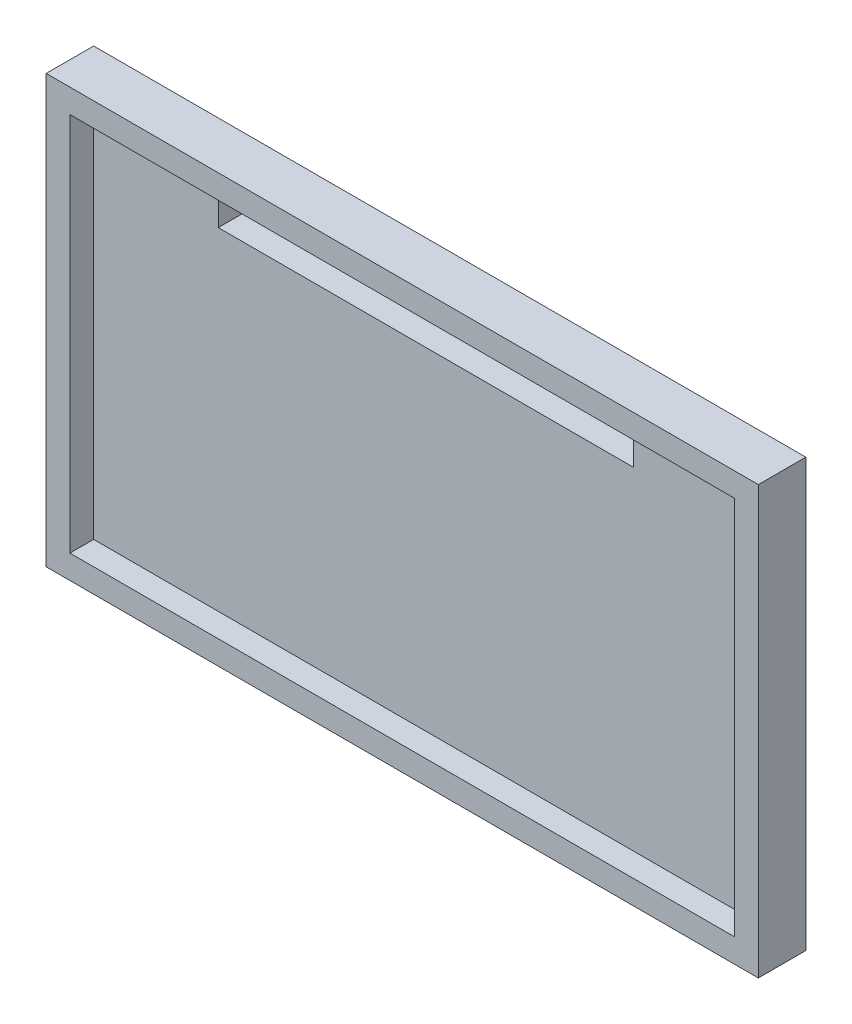
ISO-10303-21;
HEADER;
FILE_DESCRIPTION(('STEP AP214'),'2;1');
FILE_NAME('part.step','',(''),(''),'','','');
FILE_SCHEMA(('AUTOMOTIVE_DESIGN { 1 0 10303 214 1 1 1 1 }'));
ENDSEC;
DATA;
#1=APPLICATION_CONTEXT('core data for automotive mechanical design processes');
#2=APPLICATION_PROTOCOL_DEFINITION('international standard','automotive_design',2000,#1);
#3=PRODUCT_CONTEXT('',#1,'mechanical');
#4=PRODUCT('Part','Part','',(#3));
#5=PRODUCT_RELATED_PRODUCT_CATEGORY('part','',(#4));
#6=PRODUCT_DEFINITION_FORMATION('','',#4);
#7=PRODUCT_DEFINITION_CONTEXT('part definition',#1,'design');
#8=PRODUCT_DEFINITION('design','',#6,#7);
#9=PRODUCT_DEFINITION_SHAPE('','',#8);
#10=(LENGTH_UNIT() NAMED_UNIT(*) SI_UNIT(.MILLI.,.METRE.));
#11=(NAMED_UNIT(*) PLANE_ANGLE_UNIT() SI_UNIT($,.RADIAN.));
#12=(NAMED_UNIT(*) SI_UNIT($,.STERADIAN.) SOLID_ANGLE_UNIT());
#13=UNCERTAINTY_MEASURE_WITH_UNIT(LENGTH_MEASURE(1.E-05),#10,'distance_accuracy_value','');
#14=(GEOMETRIC_REPRESENTATION_CONTEXT(3) GLOBAL_UNCERTAINTY_ASSIGNED_CONTEXT((#13)) GLOBAL_UNIT_ASSIGNED_CONTEXT((#10,
#11,#12)) REPRESENTATION_CONTEXT('',''));
#15=CARTESIAN_POINT('',(0.,0.,0.));
#16=DIRECTION('',(0.,0.,1.));
#17=DIRECTION('',(1.,0.,0.));
#18=AXIS2_PLACEMENT_3D('',#15,#16,#17);
#19=CARTESIAN_POINT('',(0.,0.,2.));
#20=DIRECTION('',(0.,0.,1.));
#21=DIRECTION('',(1.,0.,0.));
#22=AXIS2_PLACEMENT_3D('',#19,#20,#21);
#23=PLANE('',#22);
#24=DIRECTION('',(0.,1.,0.));
#25=VECTOR('',#24,1.);
#26=CARTESIAN_POINT('',(28.,-16.,2.));
#27=LINE('',#26,#25);
#28=CARTESIAN_POINT('',(28.,-16.,2.));
#29=VERTEX_POINT('',#28);
#30=CARTESIAN_POINT('',(28.,16.,2.));
#31=VERTEX_POINT('',#30);
#32=EDGE_CURVE('E164',#29,#31,#27,.T.);
#33=ORIENTED_EDGE('',*,*,#32,.T.);
#34=DIRECTION('',(-1.,0.,0.));
#35=VECTOR('',#34,1.);
#36=CARTESIAN_POINT('',(28.,16.,2.));
#37=LINE('',#36,#35);
#38=CARTESIAN_POINT('',(17.5,16.,2.));
#39=VERTEX_POINT('',#38);
#40=EDGE_CURVE('E50',#31,#39,#37,.T.);
#41=ORIENTED_EDGE('',*,*,#40,.T.);
#42=DIRECTION('',(0.,1.,0.));
#43=VECTOR('',#42,1.);
#44=CARTESIAN_POINT('',(17.5,16.,2.));
#45=LINE('',#44,#43);
#46=CARTESIAN_POINT('',(17.5,12.,2.));
#47=VERTEX_POINT('',#46);
#48=EDGE_CURVE('E198',#47,#39,#45,.T.);
#49=ORIENTED_EDGE('',*,*,#48,.F.);
#50=DIRECTION('',(1.,0.,0.));
#51=VECTOR('',#50,1.);
#52=CARTESIAN_POINT('',(-17.5,12.,2.));
#53=LINE('',#52,#51);
#54=CARTESIAN_POINT('',(-17.5,12.,2.));
#55=VERTEX_POINT('',#54);
#56=EDGE_CURVE('E206',#55,#47,#53,.T.);
#57=ORIENTED_EDGE('',*,*,#56,.F.);
#58=DIRECTION('',(0.,-1.,0.));
#59=VECTOR('',#58,1.);
#60=CARTESIAN_POINT('',(-17.5,16.,2.));
#61=LINE('',#60,#59);
#62=CARTESIAN_POINT('',(-17.5,16.,2.));
#63=VERTEX_POINT('',#62);
#64=EDGE_CURVE('E202',#63,#55,#61,.T.);
#65=ORIENTED_EDGE('',*,*,#64,.F.);
#66=CARTESIAN_POINT('',(-28.,16.,2.));
#67=VERTEX_POINT('',#66);
#68=EDGE_CURVE('E11',#63,#67,#37,.T.);
#69=ORIENTED_EDGE('',*,*,#68,.T.);
#70=DIRECTION('',(0.,-1.,0.));
#71=VECTOR('',#70,1.);
#72=CARTESIAN_POINT('',(-28.,16.,2.));
#73=LINE('',#72,#71);
#74=CARTESIAN_POINT('',(-28.,-16.,2.));
#75=VERTEX_POINT('',#74);
#76=EDGE_CURVE('E168',#67,#75,#73,.T.);
#77=ORIENTED_EDGE('',*,*,#76,.T.);
#78=DIRECTION('',(1.,0.,0.));
#79=VECTOR('',#78,1.);
#80=CARTESIAN_POINT('',(-28.,-16.,2.));
#81=LINE('',#80,#79);
#82=EDGE_CURVE('E142',#75,#29,#81,.T.);
#83=ORIENTED_EDGE('',*,*,#82,.T.);
#84=EDGE_LOOP('',(#33,#41,#49,#57,#65,#69,#77,#83));
#85=FACE_BOUND('',#84,.T.);
#86=ADVANCED_FACE('F39',(#85),#23,.T.);
#87=CARTESIAN_POINT('',(0.,0.,0.));
#88=DIRECTION('',(0.,0.,1.));
#89=DIRECTION('',(1.,0.,0.));
#90=AXIS2_PLACEMENT_3D('',#87,#88,#89);
#91=PLANE('',#90);
#92=DIRECTION('',(0.,1.,0.));
#93=VECTOR('',#92,1.);
#94=CARTESIAN_POINT('',(30.,18.,0.));
#95=LINE('',#94,#93);
#96=CARTESIAN_POINT('',(30.,-18.,0.));
#97=VERTEX_POINT('',#96);
#98=CARTESIAN_POINT('',(30.,18.,0.));
#99=VERTEX_POINT('',#98);
#100=EDGE_CURVE('E236',#97,#99,#95,.T.);
#101=ORIENTED_EDGE('',*,*,#100,.F.);
#102=DIRECTION('',(1.,0.,0.));
#103=VECTOR('',#102,1.);
#104=CARTESIAN_POINT('',(-30.,-18.,0.));
#105=LINE('',#104,#103);
#106=CARTESIAN_POINT('',(-30.,-18.,0.));
#107=VERTEX_POINT('',#106);
#108=EDGE_CURVE('E246',#107,#97,#105,.T.);
#109=ORIENTED_EDGE('',*,*,#108,.F.);
#110=DIRECTION('',(0.,-1.,0.));
#111=VECTOR('',#110,1.);
#112=CARTESIAN_POINT('',(-30.,18.,0.));
#113=LINE('',#112,#111);
#114=CARTESIAN_POINT('',(-30.,18.,0.));
#115=VERTEX_POINT('',#114);
#116=EDGE_CURVE('E243',#115,#107,#113,.T.);
#117=ORIENTED_EDGE('',*,*,#116,.F.);
#118=DIRECTION('',(-1.,0.,0.));
#119=VECTOR('',#118,1.);
#120=CARTESIAN_POINT('',(-30.,18.,0.));
#121=LINE('',#120,#119);
#122=EDGE_CURVE('E240',#99,#115,#121,.T.);
#123=ORIENTED_EDGE('',*,*,#122,.F.);
#124=EDGE_LOOP('',(#101,#109,#117,#123));
#125=FACE_BOUND('',#124,.T.);
#126=DIRECTION('',(0.,1.,0.));
#127=VECTOR('',#126,1.);
#128=CARTESIAN_POINT('',(17.5,16.,0.));
#129=LINE('',#128,#127);
#130=CARTESIAN_POINT('',(17.5,12.,0.));
#131=VERTEX_POINT('',#130);
#132=CARTESIAN_POINT('',(17.5,16.,0.));
#133=VERTEX_POINT('',#132);
#134=EDGE_CURVE('E197',#131,#133,#129,.T.);
#135=ORIENTED_EDGE('',*,*,#134,.T.);
#136=DIRECTION('',(-1.,0.,0.));
#137=VECTOR('',#136,1.);
#138=CARTESIAN_POINT('',(-17.5,16.,0.));
#139=LINE('',#138,#137);
#140=CARTESIAN_POINT('',(-17.5,16.,0.));
#141=VERTEX_POINT('',#140);
#142=EDGE_CURVE('E213',#133,#141,#139,.T.);
#143=ORIENTED_EDGE('',*,*,#142,.T.);
#144=DIRECTION('',(0.,-1.,0.));
#145=VECTOR('',#144,1.);
#146=CARTESIAN_POINT('',(-17.5,16.,0.));
#147=LINE('',#146,#145);
#148=CARTESIAN_POINT('',(-17.5,12.,0.));
#149=VERTEX_POINT('',#148);
#150=EDGE_CURVE('E217',#141,#149,#147,.T.);
#151=ORIENTED_EDGE('',*,*,#150,.T.);
#152=DIRECTION('',(1.,0.,0.));
#153=VECTOR('',#152,1.);
#154=CARTESIAN_POINT('',(-17.5,12.,0.));
#155=LINE('',#154,#153);
#156=EDGE_CURVE('E203',#149,#131,#155,.T.);
#157=ORIENTED_EDGE('',*,*,#156,.T.);
#158=EDGE_LOOP('',(#135,#143,#151,#157));
#159=FACE_BOUND('',#158,.T.);
#160=ADVANCED_FACE('F272',(#125,#159),#91,.F.);
#161=CARTESIAN_POINT('',(30.,18.,2.));
#162=DIRECTION('',(-1.,0.,0.));
#163=DIRECTION('',(0.,-1.,0.));
#164=AXIS2_PLACEMENT_3D('',#161,#162,#163);
#165=PLANE('',#164);
#166=ORIENTED_EDGE('',*,*,#100,.T.);
#167=DIRECTION('',(0.,0.,-1.));
#168=VECTOR('',#167,1.);
#169=CARTESIAN_POINT('',(30.,18.,2.));
#170=LINE('',#169,#168);
#171=CARTESIAN_POINT('',(30.,18.,4.));
#172=VERTEX_POINT('',#171);
#173=EDGE_CURVE('E43',#172,#99,#170,.T.);
#174=ORIENTED_EDGE('',*,*,#173,.F.);
#175=DIRECTION('',(0.,1.,0.));
#176=VECTOR('',#175,1.);
#177=CARTESIAN_POINT('',(30.,-18.,4.));
#178=LINE('',#177,#176);
#179=CARTESIAN_POINT('',(30.,-18.,4.));
#180=VERTEX_POINT('',#179);
#181=EDGE_CURVE('E149',#180,#172,#178,.T.);
#182=ORIENTED_EDGE('',*,*,#181,.F.);
#183=DIRECTION('',(0.,0.,-1.));
#184=VECTOR('',#183,1.);
#185=CARTESIAN_POINT('',(30.,-18.,2.));
#186=LINE('',#185,#184);
#187=EDGE_CURVE('E249',#180,#97,#186,.T.);
#188=ORIENTED_EDGE('',*,*,#187,.T.);
#189=EDGE_LOOP('',(#166,#174,#182,#188));
#190=FACE_BOUND('',#189,.T.);
#191=ADVANCED_FACE('F41',(#190),#165,.F.);
#192=CARTESIAN_POINT('',(-30.,18.,2.));
#193=DIRECTION('',(0.,-1.,0.));
#194=DIRECTION('',(0.,0.,-1.));
#195=AXIS2_PLACEMENT_3D('',#192,#193,#194);
#196=PLANE('',#195);
#197=ORIENTED_EDGE('',*,*,#122,.T.);
#198=DIRECTION('',(0.,0.,-1.));
#199=VECTOR('',#198,1.);
#200=CARTESIAN_POINT('',(-30.,18.,2.));
#201=LINE('',#200,#199);
#202=CARTESIAN_POINT('',(-30.,18.,4.));
#203=VERTEX_POINT('',#202);
#204=EDGE_CURVE('E256',#203,#115,#201,.T.);
#205=ORIENTED_EDGE('',*,*,#204,.F.);
#206=DIRECTION('',(-1.,0.,0.));
#207=VECTOR('',#206,1.);
#208=CARTESIAN_POINT('',(30.,18.,4.));
#209=LINE('',#208,#207);
#210=EDGE_CURVE('E185',#172,#203,#209,.T.);
#211=ORIENTED_EDGE('',*,*,#210,.F.);
#212=ORIENTED_EDGE('',*,*,#173,.T.);
#213=EDGE_LOOP('',(#197,#205,#211,#212));
#214=FACE_BOUND('',#213,.T.);
#215=ADVANCED_FACE('F266',(#214),#196,.F.);
#216=CARTESIAN_POINT('',(-30.,18.,2.));
#217=DIRECTION('',(1.,0.,0.));
#218=DIRECTION('',(0.,0.,-1.));
#219=AXIS2_PLACEMENT_3D('',#216,#217,#218);
#220=PLANE('',#219);
#221=ORIENTED_EDGE('',*,*,#116,.T.);
#222=DIRECTION('',(0.,0.,-1.));
#223=VECTOR('',#222,1.);
#224=CARTESIAN_POINT('',(-30.,-18.,2.));
#225=LINE('',#224,#223);
#226=CARTESIAN_POINT('',(-30.,-18.,4.));
#227=VERTEX_POINT('',#226);
#228=EDGE_CURVE('E253',#227,#107,#225,.T.);
#229=ORIENTED_EDGE('',*,*,#228,.F.);
#230=DIRECTION('',(0.,-1.,0.));
#231=VECTOR('',#230,1.);
#232=CARTESIAN_POINT('',(-30.,18.,4.));
#233=LINE('',#232,#231);
#234=EDGE_CURVE('E189',#203,#227,#233,.T.);
#235=ORIENTED_EDGE('',*,*,#234,.F.);
#236=ORIENTED_EDGE('',*,*,#204,.T.);
#237=EDGE_LOOP('',(#221,#229,#235,#236));
#238=FACE_BOUND('',#237,.T.);
#239=ADVANCED_FACE('F274',(#238),#220,.F.);
#240=CARTESIAN_POINT('',(-30.,-18.,2.));
#241=DIRECTION('',(0.,1.,0.));
#242=DIRECTION('',(0.,0.,1.));
#243=AXIS2_PLACEMENT_3D('',#240,#241,#242);
#244=PLANE('',#243);
#245=ORIENTED_EDGE('',*,*,#108,.T.);
#246=ORIENTED_EDGE('',*,*,#187,.F.);
#247=DIRECTION('',(1.,0.,0.));
#248=VECTOR('',#247,1.);
#249=CARTESIAN_POINT('',(-30.,-18.,4.));
#250=LINE('',#249,#248);
#251=EDGE_CURVE('E193',#227,#180,#250,.T.);
#252=ORIENTED_EDGE('',*,*,#251,.F.);
#253=ORIENTED_EDGE('',*,*,#228,.T.);
#254=EDGE_LOOP('',(#245,#246,#252,#253));
#255=FACE_BOUND('',#254,.T.);
#256=ADVANCED_FACE('F277',(#255),#244,.F.);
#257=CARTESIAN_POINT('',(17.5,16.,2.));
#258=DIRECTION('',(-1.,0.,0.));
#259=DIRECTION('',(0.,0.,1.));
#260=AXIS2_PLACEMENT_3D('',#257,#258,#259);
#261=PLANE('',#260);
#262=ORIENTED_EDGE('',*,*,#134,.F.);
#263=DIRECTION('',(0.,0.,-1.));
#264=VECTOR('',#263,1.);
#265=CARTESIAN_POINT('',(17.5,12.,2.));
#266=LINE('',#265,#264);
#267=EDGE_CURVE('E209',#47,#131,#266,.T.);
#268=ORIENTED_EDGE('',*,*,#267,.F.);
#269=ORIENTED_EDGE('',*,*,#48,.T.);
#270=DIRECTION('',(0.,0.,-1.));
#271=VECTOR('',#270,1.);
#272=CARTESIAN_POINT('',(17.5,16.,2.));
#273=LINE('',#272,#271);
#274=EDGE_CURVE('E232',#39,#133,#273,.T.);
#275=ORIENTED_EDGE('',*,*,#274,.T.);
#276=EDGE_LOOP('',(#262,#268,#269,#275));
#277=FACE_BOUND('',#276,.T.);
#278=ADVANCED_FACE('F301',(#277),#261,.T.);
#279=CARTESIAN_POINT('',(-17.5,16.,2.));
#280=DIRECTION('',(0.,-1.,0.));
#281=DIRECTION('',(0.,0.,-1.));
#282=AXIS2_PLACEMENT_3D('',#279,#280,#281);
#283=PLANE('',#282);
#284=ORIENTED_EDGE('',*,*,#142,.F.);
#285=ORIENTED_EDGE('',*,*,#274,.F.);
#286=ORIENTED_EDGE('',*,*,#40,.F.);
#287=DIRECTION('',(0.,0.,-1.));
#288=VECTOR('',#287,1.);
#289=CARTESIAN_POINT('',(28.,16.,4.));
#290=LINE('',#289,#288);
#291=CARTESIAN_POINT('',(28.,16.,4.));
#292=VERTEX_POINT('',#291);
#293=EDGE_CURVE('E135',#292,#31,#290,.T.);
#294=ORIENTED_EDGE('',*,*,#293,.F.);
#295=DIRECTION('',(-1.,0.,0.));
#296=VECTOR('',#295,1.);
#297=CARTESIAN_POINT('',(28.,16.,4.));
#298=LINE('',#297,#296);
#299=CARTESIAN_POINT('',(-28.,16.,4.));
#300=VERTEX_POINT('',#299);
#301=EDGE_CURVE('E141',#292,#300,#298,.T.);
#302=ORIENTED_EDGE('',*,*,#301,.T.);
#303=DIRECTION('',(0.,0.,-1.));
#304=VECTOR('',#303,1.);
#305=CARTESIAN_POINT('',(-28.,16.,4.));
#306=LINE('',#305,#304);
#307=EDGE_CURVE('E150',#300,#67,#306,.T.);
#308=ORIENTED_EDGE('',*,*,#307,.T.);
#309=ORIENTED_EDGE('',*,*,#68,.F.);
#310=DIRECTION('',(0.,0.,-1.));
#311=VECTOR('',#310,1.);
#312=CARTESIAN_POINT('',(-17.5,16.,2.));
#313=LINE('',#312,#311);
#314=EDGE_CURVE('E229',#63,#141,#313,.T.);
#315=ORIENTED_EDGE('',*,*,#314,.T.);
#316=EDGE_LOOP('',(#284,#285,#286,#294,#302,#308,#309,#315));
#317=FACE_BOUND('',#316,.T.);
#318=ADVANCED_FACE('F145',(#317),#283,.T.);
#319=CARTESIAN_POINT('',(-17.5,16.,2.));
#320=DIRECTION('',(1.,0.,0.));
#321=DIRECTION('',(0.,1.,0.));
#322=AXIS2_PLACEMENT_3D('',#319,#320,#321);
#323=PLANE('',#322);
#324=ORIENTED_EDGE('',*,*,#150,.F.);
#325=ORIENTED_EDGE('',*,*,#314,.F.);
#326=ORIENTED_EDGE('',*,*,#64,.T.);
#327=DIRECTION('',(0.,0.,-1.));
#328=VECTOR('',#327,1.);
#329=CARTESIAN_POINT('',(-17.5,12.,2.));
#330=LINE('',#329,#328);
#331=EDGE_CURVE('E65',#55,#149,#330,.T.);
#332=ORIENTED_EDGE('',*,*,#331,.T.);
#333=EDGE_LOOP('',(#324,#325,#326,#332));
#334=FACE_BOUND('',#333,.T.);
#335=ADVANCED_FACE('F289',(#334),#323,.T.);
#336=CARTESIAN_POINT('',(-17.5,12.,2.));
#337=DIRECTION('',(0.,1.,0.));
#338=DIRECTION('',(0.,0.,1.));
#339=AXIS2_PLACEMENT_3D('',#336,#337,#338);
#340=PLANE('',#339);
#341=ORIENTED_EDGE('',*,*,#156,.F.);
#342=ORIENTED_EDGE('',*,*,#331,.F.);
#343=ORIENTED_EDGE('',*,*,#56,.T.);
#344=ORIENTED_EDGE('',*,*,#267,.T.);
#345=EDGE_LOOP('',(#341,#342,#343,#344));
#346=FACE_BOUND('',#345,.T.);
#347=ADVANCED_FACE('F280',(#346),#340,.T.);
#348=CARTESIAN_POINT('',(0.,0.,4.));
#349=DIRECTION('',(0.,0.,1.));
#350=DIRECTION('',(1.,0.,0.));
#351=AXIS2_PLACEMENT_3D('',#348,#349,#350);
#352=PLANE('',#351);
#353=ORIENTED_EDGE('',*,*,#181,.T.);
#354=ORIENTED_EDGE('',*,*,#210,.T.);
#355=ORIENTED_EDGE('',*,*,#234,.T.);
#356=ORIENTED_EDGE('',*,*,#251,.T.);
#357=EDGE_LOOP('',(#353,#354,#355,#356));
#358=FACE_BOUND('',#357,.T.);
#359=ORIENTED_EDGE('',*,*,#301,.F.);
#360=DIRECTION('',(0.,1.,0.));
#361=VECTOR('',#360,1.);
#362=CARTESIAN_POINT('',(28.,-16.,4.));
#363=LINE('',#362,#361);
#364=CARTESIAN_POINT('',(28.,-16.,4.));
#365=VERTEX_POINT('',#364);
#366=EDGE_CURVE('E132',#365,#292,#363,.T.);
#367=ORIENTED_EDGE('',*,*,#366,.F.);
#368=DIRECTION('',(1.,0.,0.));
#369=VECTOR('',#368,1.);
#370=CARTESIAN_POINT('',(-28.,-16.,4.));
#371=LINE('',#370,#369);
#372=CARTESIAN_POINT('',(-28.,-16.,4.));
#373=VERTEX_POINT('',#372);
#374=EDGE_CURVE('E159',#373,#365,#371,.T.);
#375=ORIENTED_EDGE('',*,*,#374,.F.);
#376=DIRECTION('',(0.,-1.,0.));
#377=VECTOR('',#376,1.);
#378=CARTESIAN_POINT('',(-28.,16.,4.));
#379=LINE('',#378,#377);
#380=EDGE_CURVE('E155',#300,#373,#379,.T.);
#381=ORIENTED_EDGE('',*,*,#380,.F.);
#382=EDGE_LOOP('',(#359,#367,#375,#381));
#383=FACE_BOUND('',#382,.T.);
#384=ADVANCED_FACE('F153',(#358,#383),#352,.T.);
#385=CARTESIAN_POINT('',(28.,-16.,4.));
#386=DIRECTION('',(-1.,0.,0.));
#387=DIRECTION('',(0.,0.,1.));
#388=AXIS2_PLACEMENT_3D('',#385,#386,#387);
#389=PLANE('',#388);
#390=ORIENTED_EDGE('',*,*,#32,.F.);
#391=DIRECTION('',(0.,0.,-1.));
#392=VECTOR('',#391,1.);
#393=CARTESIAN_POINT('',(28.,-16.,4.));
#394=LINE('',#393,#392);
#395=EDGE_CURVE('E57',#365,#29,#394,.T.);
#396=ORIENTED_EDGE('',*,*,#395,.F.);
#397=ORIENTED_EDGE('',*,*,#366,.T.);
#398=ORIENTED_EDGE('',*,*,#293,.T.);
#399=EDGE_LOOP('',(#390,#396,#397,#398));
#400=FACE_BOUND('',#399,.T.);
#401=ADVANCED_FACE('F134',(#400),#389,.T.);
#402=CARTESIAN_POINT('',(-28.,16.,4.));
#403=DIRECTION('',(1.,0.,0.));
#404=DIRECTION('',(0.,0.,-1.));
#405=AXIS2_PLACEMENT_3D('',#402,#403,#404);
#406=PLANE('',#405);
#407=ORIENTED_EDGE('',*,*,#76,.F.);
#408=ORIENTED_EDGE('',*,*,#307,.F.);
#409=ORIENTED_EDGE('',*,*,#380,.T.);
#410=DIRECTION('',(0.,0.,-1.));
#411=VECTOR('',#410,1.);
#412=CARTESIAN_POINT('',(-28.,-16.,4.));
#413=LINE('',#412,#411);
#414=EDGE_CURVE('E177',#373,#75,#413,.T.);
#415=ORIENTED_EDGE('',*,*,#414,.T.);
#416=EDGE_LOOP('',(#407,#408,#409,#415));
#417=FACE_BOUND('',#416,.T.);
#418=ADVANCED_FACE('F286',(#417),#406,.T.);
#419=CARTESIAN_POINT('',(-28.,-16.,4.));
#420=DIRECTION('',(0.,1.,0.));
#421=DIRECTION('',(0.,0.,1.));
#422=AXIS2_PLACEMENT_3D('',#419,#420,#421);
#423=PLANE('',#422);
#424=ORIENTED_EDGE('',*,*,#82,.F.);
#425=ORIENTED_EDGE('',*,*,#414,.F.);
#426=ORIENTED_EDGE('',*,*,#374,.T.);
#427=ORIENTED_EDGE('',*,*,#395,.T.);
#428=EDGE_LOOP('',(#424,#425,#426,#427));
#429=FACE_BOUND('',#428,.T.);
#430=ADVANCED_FACE('F393',(#429),#423,.T.);
#431=CLOSED_SHELL('',(#86,#160,#191,#215,#239,#256,#278,#318,#335,#347,#384,#401,#418,#430));
#432=MANIFOLD_SOLID_BREP('B2',#431);
#433=ADVANCED_BREP_SHAPE_REPRESENTATION('',(#18,#432),#14);
#434=SHAPE_DEFINITION_REPRESENTATION(#9,#433);
ENDSEC;
END-ISO-10303-21;
